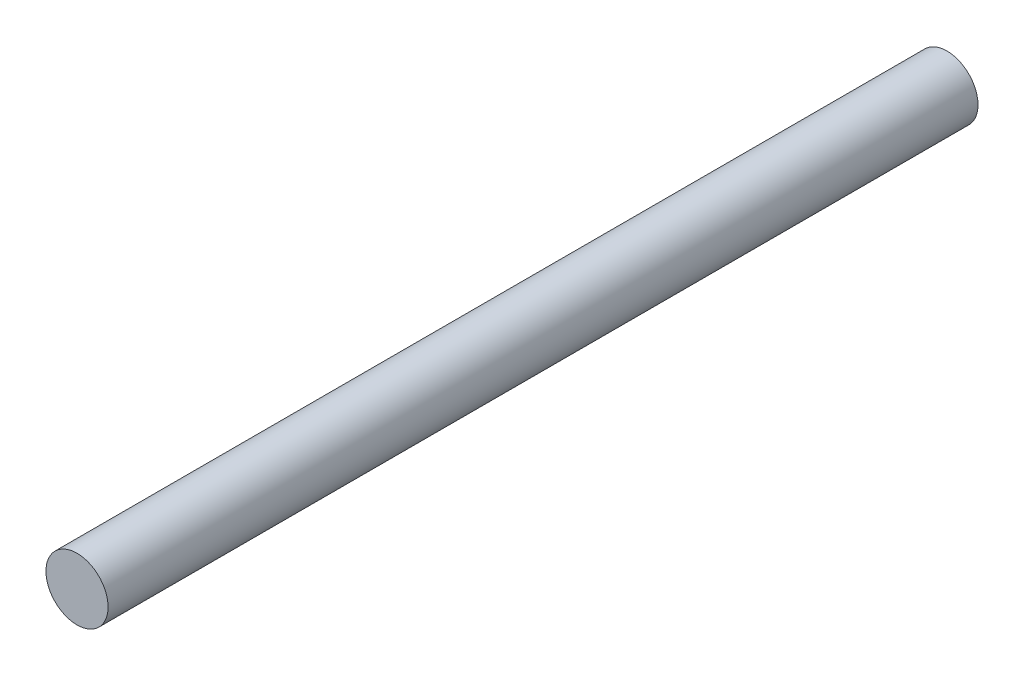
ISO-10303-21;
HEADER;
FILE_DESCRIPTION(('STEP AP214'),'2;1');
FILE_NAME('part.step','',(''),(''),'','','');
FILE_SCHEMA(('AUTOMOTIVE_DESIGN { 1 0 10303 214 1 1 1 1 }'));
ENDSEC;
DATA;
#1=APPLICATION_CONTEXT('core data for automotive mechanical design processes');
#2=APPLICATION_PROTOCOL_DEFINITION('international standard','automotive_design',2000,#1);
#3=PRODUCT_CONTEXT('',#1,'mechanical');
#4=PRODUCT('Part','Part','',(#3));
#5=PRODUCT_RELATED_PRODUCT_CATEGORY('part','',(#4));
#6=PRODUCT_DEFINITION_FORMATION('','',#4);
#7=PRODUCT_DEFINITION_CONTEXT('part definition',#1,'design');
#8=PRODUCT_DEFINITION('design','',#6,#7);
#9=PRODUCT_DEFINITION_SHAPE('','',#8);
#10=(LENGTH_UNIT() NAMED_UNIT(*) SI_UNIT(.MILLI.,.METRE.));
#11=(NAMED_UNIT(*) PLANE_ANGLE_UNIT() SI_UNIT($,.RADIAN.));
#12=(NAMED_UNIT(*) SI_UNIT($,.STERADIAN.) SOLID_ANGLE_UNIT());
#13=UNCERTAINTY_MEASURE_WITH_UNIT(LENGTH_MEASURE(1.E-05),#10,'distance_accuracy_value','');
#14=(GEOMETRIC_REPRESENTATION_CONTEXT(3) GLOBAL_UNCERTAINTY_ASSIGNED_CONTEXT((#13)) GLOBAL_UNIT_ASSIGNED_CONTEXT((#10,
#11,#12)) REPRESENTATION_CONTEXT('',''));
#15=CARTESIAN_POINT('',(0.,0.,0.));
#16=DIRECTION('',(0.,0.,1.));
#17=DIRECTION('',(1.,0.,0.));
#18=AXIS2_PLACEMENT_3D('',#15,#16,#17);
#19=CARTESIAN_POINT('',(0.,0.,70.));
#20=DIRECTION('',(0.,0.,-1.));
#21=DIRECTION('',(-1.,0.,0.));
#22=AXIS2_PLACEMENT_3D('',#19,#20,#21);
#23=CYLINDRICAL_SURFACE('',#22,5.);
#24=CARTESIAN_POINT('',(0.,0.,70.));
#25=DIRECTION('',(0.,0.,1.));
#26=DIRECTION('',(1.,0.,0.));
#27=AXIS2_PLACEMENT_3D('',#24,#25,#26);
#28=CIRCLE('',#27,5.);
#29=CARTESIAN_POINT('',(5.,0.,70.));
#30=VERTEX_POINT('',#29);
#31=EDGE_CURVE('E10',#30,#30,#28,.T.);
#32=ORIENTED_EDGE('',*,*,#31,.F.);
#33=EDGE_LOOP('',(#32));
#34=FACE_BOUND('',#33,.T.);
#35=CARTESIAN_POINT('',(0.,0.,-70.));
#36=DIRECTION('',(0.,0.,1.));
#37=DIRECTION('',(1.,0.,0.));
#38=AXIS2_PLACEMENT_3D('',#35,#36,#37);
#39=CIRCLE('',#38,5.);
#40=CARTESIAN_POINT('',(5.,0.,-70.));
#41=VERTEX_POINT('',#40);
#42=EDGE_CURVE('E34',#41,#41,#39,.T.);
#43=ORIENTED_EDGE('',*,*,#42,.T.);
#44=EDGE_LOOP('',(#43));
#45=FACE_BOUND('',#44,.T.);
#46=ADVANCED_FACE('F31',(#34,#45),#23,.T.);
#47=CARTESIAN_POINT('',(0.,0.,70.));
#48=DIRECTION('',(0.,0.,1.));
#49=DIRECTION('',(1.,0.,0.));
#50=AXIS2_PLACEMENT_3D('',#47,#48,#49);
#51=PLANE('',#50);
#52=ORIENTED_EDGE('',*,*,#31,.T.);
#53=EDGE_LOOP('',(#52));
#54=FACE_BOUND('',#53,.T.);
#55=ADVANCED_FACE('F46',(#54),#51,.T.);
#56=CARTESIAN_POINT('',(0.,0.,-70.));
#57=DIRECTION('',(0.,0.,1.));
#58=DIRECTION('',(1.,0.,0.));
#59=AXIS2_PLACEMENT_3D('',#56,#57,#58);
#60=PLANE('',#59);
#61=ORIENTED_EDGE('',*,*,#42,.F.);
#62=EDGE_LOOP('',(#61));
#63=FACE_BOUND('',#62,.T.);
#64=ADVANCED_FACE('F44',(#63),#60,.F.);
#65=CLOSED_SHELL('',(#46,#55,#64));
#66=MANIFOLD_SOLID_BREP('B2',#65);
#67=ADVANCED_BREP_SHAPE_REPRESENTATION('',(#18,#66),#14);
#68=SHAPE_DEFINITION_REPRESENTATION(#9,#67);
ENDSEC;
END-ISO-10303-21;
